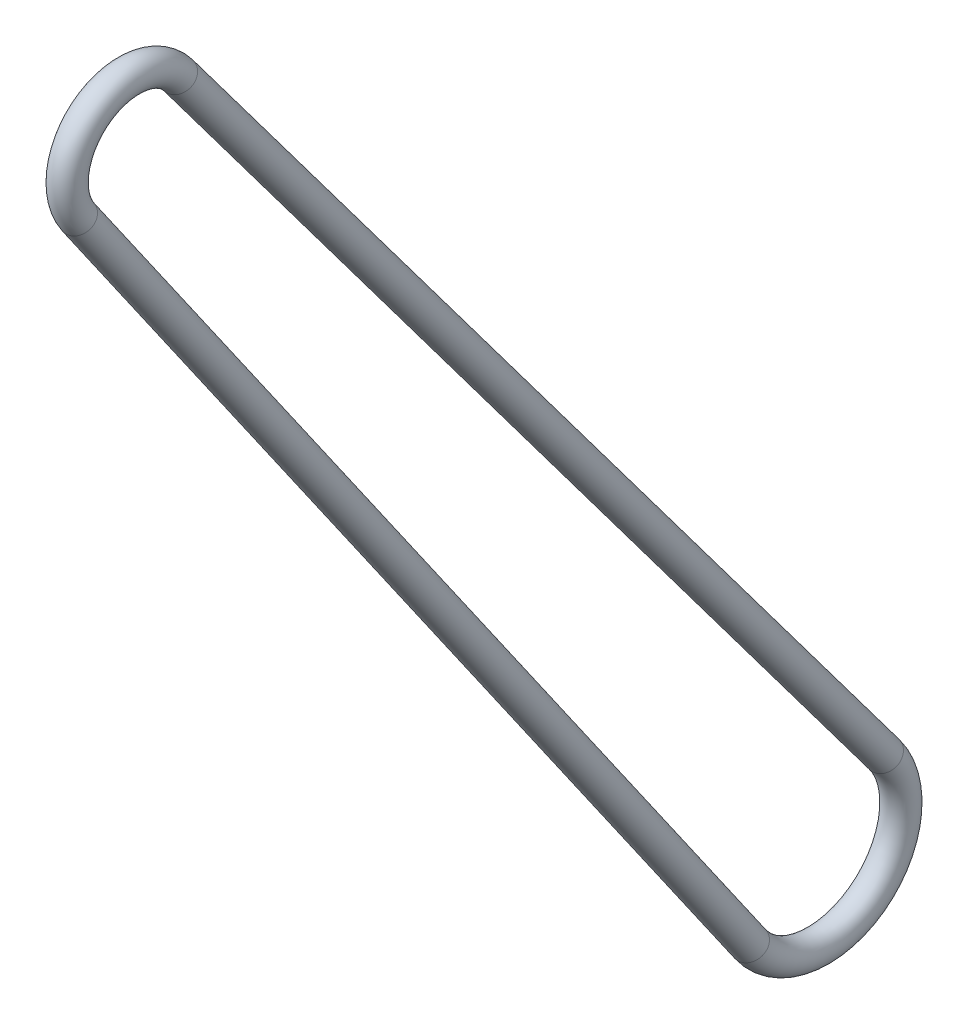
ISO-10303-21;
HEADER;
FILE_DESCRIPTION(('STEP AP214'),'2;1');
FILE_NAME('part.step','',(''),(''),'','','');
FILE_SCHEMA(('AUTOMOTIVE_DESIGN { 1 0 10303 214 1 1 1 1 }'));
ENDSEC;
DATA;
#1=APPLICATION_CONTEXT('core data for automotive mechanical design processes');
#2=APPLICATION_PROTOCOL_DEFINITION('international standard','automotive_design',2000,#1);
#3=PRODUCT_CONTEXT('',#1,'mechanical');
#4=PRODUCT('Part','Part','',(#3));
#5=PRODUCT_RELATED_PRODUCT_CATEGORY('part','',(#4));
#6=PRODUCT_DEFINITION_FORMATION('','',#4);
#7=PRODUCT_DEFINITION_CONTEXT('part definition',#1,'design');
#8=PRODUCT_DEFINITION('design','',#6,#7);
#9=PRODUCT_DEFINITION_SHAPE('','',#8);
#10=(LENGTH_UNIT() NAMED_UNIT(*) SI_UNIT(.MILLI.,.METRE.));
#11=(NAMED_UNIT(*) PLANE_ANGLE_UNIT() SI_UNIT($,.RADIAN.));
#12=(NAMED_UNIT(*) SI_UNIT($,.STERADIAN.) SOLID_ANGLE_UNIT());
#13=UNCERTAINTY_MEASURE_WITH_UNIT(LENGTH_MEASURE(1.E-05),#10,'distance_accuracy_value','');
#14=(GEOMETRIC_REPRESENTATION_CONTEXT(3) GLOBAL_UNCERTAINTY_ASSIGNED_CONTEXT((#13)) GLOBAL_UNIT_ASSIGNED_CONTEXT((#10,
#11,#12)) REPRESENTATION_CONTEXT('',''));
#15=CARTESIAN_POINT('',(0.,0.,0.));
#16=DIRECTION('',(0.,0.,1.));
#17=DIRECTION('',(1.,0.,0.));
#18=AXIS2_PLACEMENT_3D('',#15,#16,#17);
#19=CARTESIAN_POINT('',(0.,4.93279924297345,-6.5754942501796));
#20=DIRECTION('',(0.,-0.799931174615758,-0.600091756215542));
#21=DIRECTION('',(0.,0.600091756215542,-0.799931174615758));
#22=AXIS2_PLACEMENT_3D('',#19,#20,#21);
#23=CYLINDRICAL_SURFACE('',#22,1.984375);
#24=CARTESIAN_POINT('',(0.,-120.069650872454,-100.349736586771));
#25=DIRECTION('',(0.,0.799931174615759,0.600091756215542));
#26=DIRECTION('',(0.,-0.600091756215542,0.799931174615759));
#27=AXIS2_PLACEMENT_3D('',#24,#25,#26);
#28=CIRCLE('',#27,1.984375);
#29=CARTESIAN_POINT('',(0.,-118.878843793714,-101.9371000114));
#30=VERTEX_POINT('',#29);
#31=EDGE_CURVE('E42',#30,#30,#28,.T.);
#32=ORIENTED_EDGE('',*,*,#31,.T.);
#33=EDGE_LOOP('',(#32));
#34=FACE_BOUND('',#33,.T.);
#35=CARTESIAN_POINT('',(0.,4.93279924297345,-6.5754942501796));
#36=DIRECTION('',(0.,0.799931174615759,0.600091756215542));
#37=DIRECTION('',(0.,-0.600091756215542,0.799931174615759));
#38=AXIS2_PLACEMENT_3D('',#35,#36,#37);
#39=CIRCLE('',#38,1.984375);
#40=CARTESIAN_POINT('',(0.,6.12360632171366,-8.16285767480775));
#41=VERTEX_POINT('',#40);
#42=EDGE_CURVE('E46',#41,#41,#39,.T.);
#43=ORIENTED_EDGE('',*,*,#42,.F.);
#44=EDGE_LOOP('',(#43));
#45=FACE_BOUND('',#44,.T.);
#46=ADVANCED_FACE('F31',(#34,#45),#23,.T.);
#47=CARTESIAN_POINT('',(0.,-126.670660190825,-91.5504936659981));
#48=DIRECTION('',(-1.,0.,0.));
#49=DIRECTION('',(0.,0.,1.));
#50=AXIS2_PLACEMENT_3D('',#47,#48,#49);
#51=TOROIDAL_SURFACE('',#50,11.,1.984375);
#52=CARTESIAN_POINT('',(0.,-132.954521077895,-82.5220335341727));
#53=DIRECTION('',(0.,-0.82076910289321,-0.571260080642675));
#54=DIRECTION('',(0.,0.571260080642674,-0.82076910289321));
#55=AXIS2_PLACEMENT_3D('',#52,#53,#54);
#56=CIRCLE('',#55,1.984375);
#57=CARTESIAN_POINT('',(0.,-134.08811530042,-80.893319845619));
#58=VERTEX_POINT('',#57);
#59=EDGE_CURVE('E38',#58,#58,#56,.T.);
#60=CARTESIAN_POINT('',(0.,-126.670660190825,-91.5504936659981));
#61=DIRECTION('',(-1.,0.,0.));
#62=DIRECTION('',(0.,0.,1.));
#63=AXIS2_PLACEMENT_3D('',#60,#61,#62);
#64=CIRCLE('',#63,12.984375);
#65=EDGE_CURVE('',#30,#58,#64,.T.);
#66=ORIENTED_EDGE('',*,*,#31,.F.);
#67=ORIENTED_EDGE('',*,*,#59,.T.);
#68=ORIENTED_EDGE('',*,*,#65,.T.);
#69=ORIENTED_EDGE('',*,*,#65,.F.);
#70=EDGE_LOOP('',(#66,#68,#67,#69));
#71=FACE_BOUND('',#70,.T.);
#72=ADVANCED_FACE('F55',(#71),#51,.T.);
#73=CARTESIAN_POINT('',(0.,-132.954521077895,-82.5220335341727));
#74=DIRECTION('',(0.,0.82076910289321,0.571260080642675));
#75=DIRECTION('',(0.,-0.571260080642675,0.82076910289321));
#76=AXIS2_PLACEMENT_3D('',#73,#74,#75);
#77=CYLINDRICAL_SURFACE('',#76,1.984375);
#78=CARTESIAN_POINT('',(0.,-4.69580070738882,6.74678358346488));
#79=DIRECTION('',(0.,-0.82076910289321,-0.571260080642675));
#80=DIRECTION('',(0.,0.571260080642675,-0.82076910289321));
#81=AXIS2_PLACEMENT_3D('',#78,#79,#80);
#82=CIRCLE('',#81,1.984375);
#83=CARTESIAN_POINT('',(0.,-5.82939492991412,8.37549727201859));
#84=VERTEX_POINT('',#83);
#85=EDGE_CURVE('E10',#84,#84,#82,.T.);
#86=ORIENTED_EDGE('',*,*,#85,.T.);
#87=EDGE_LOOP('',(#86));
#88=FACE_BOUND('',#87,.T.);
#89=ORIENTED_EDGE('',*,*,#59,.F.);
#90=EDGE_LOOP('',(#89));
#91=FACE_BOUND('',#90,.T.);
#92=ADVANCED_FACE('F61',(#88,#91),#77,.T.);
#93=CARTESIAN_POINT('',(0.,0.,0.));
#94=DIRECTION('',(-1.,0.,0.));
#95=DIRECTION('',(0.,0.,1.));
#96=AXIS2_PLACEMENT_3D('',#93,#94,#95);
#97=TOROIDAL_SURFACE('',#96,8.22007499999997,1.984375);
#98=CARTESIAN_POINT('',(0.,0.,0.));
#99=DIRECTION('',(-1.,0.,0.));
#100=DIRECTION('',(0.,0.,1.));
#101=AXIS2_PLACEMENT_3D('',#98,#99,#100);
#102=CIRCLE('',#101,10.20445);
#103=EDGE_CURVE('',#84,#41,#102,.T.);
#104=ORIENTED_EDGE('',*,*,#85,.F.);
#105=ORIENTED_EDGE('',*,*,#42,.T.);
#106=ORIENTED_EDGE('',*,*,#103,.T.);
#107=ORIENTED_EDGE('',*,*,#103,.F.);
#108=EDGE_LOOP('',(#104,#106,#105,#107));
#109=FACE_BOUND('',#108,.T.);
#110=ADVANCED_FACE('F33',(#109),#97,.T.);
#111=CLOSED_SHELL('',(#46,#72,#92,#110));
#112=MANIFOLD_SOLID_BREP('B2',#111);
#113=ADVANCED_BREP_SHAPE_REPRESENTATION('',(#18,#112),#14);
#114=SHAPE_DEFINITION_REPRESENTATION(#9,#113);
ENDSEC;
END-ISO-10303-21;
